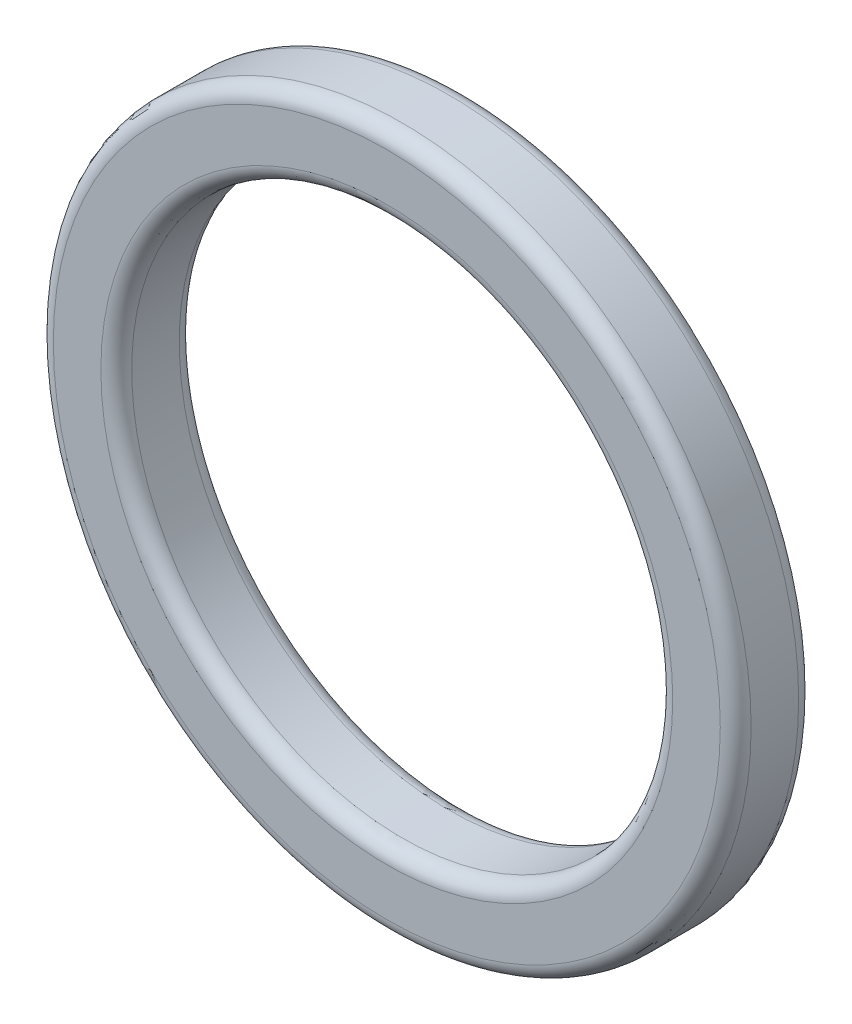
ISO-10303-21;
HEADER;
FILE_DESCRIPTION(('STEP AP214'),'2;1');
FILE_NAME('part.step','',(''),(''),'','','');
FILE_SCHEMA(('AUTOMOTIVE_DESIGN { 1 0 10303 214 1 1 1 1 }'));
ENDSEC;
DATA;
#1=APPLICATION_CONTEXT('core data for automotive mechanical design processes');
#2=APPLICATION_PROTOCOL_DEFINITION('international standard','automotive_design',2000,#1);
#3=PRODUCT_CONTEXT('',#1,'mechanical');
#4=PRODUCT('Part','Part','',(#3));
#5=PRODUCT_RELATED_PRODUCT_CATEGORY('part','',(#4));
#6=PRODUCT_DEFINITION_FORMATION('','',#4);
#7=PRODUCT_DEFINITION_CONTEXT('part definition',#1,'design');
#8=PRODUCT_DEFINITION('design','',#6,#7);
#9=PRODUCT_DEFINITION_SHAPE('','',#8);
#10=(LENGTH_UNIT() NAMED_UNIT(*) SI_UNIT(.MILLI.,.METRE.));
#11=(NAMED_UNIT(*) PLANE_ANGLE_UNIT() SI_UNIT($,.RADIAN.));
#12=(NAMED_UNIT(*) SI_UNIT($,.STERADIAN.) SOLID_ANGLE_UNIT());
#13=UNCERTAINTY_MEASURE_WITH_UNIT(LENGTH_MEASURE(1.E-05),#10,'distance_accuracy_value','');
#14=(GEOMETRIC_REPRESENTATION_CONTEXT(3) GLOBAL_UNCERTAINTY_ASSIGNED_CONTEXT((#13)) GLOBAL_UNIT_ASSIGNED_CONTEXT((#10,
#11,#12)) REPRESENTATION_CONTEXT('',''));
#15=CARTESIAN_POINT('',(0.,0.,0.));
#16=DIRECTION('',(0.,0.,1.));
#17=DIRECTION('',(1.,0.,0.));
#18=AXIS2_PLACEMENT_3D('',#15,#16,#17);
#19=CARTESIAN_POINT('',(39.784875199078,9.63463502334821,5.08));
#20=DIRECTION('',(0.,0.,1.));
#21=DIRECTION('',(1.,0.,0.));
#22=AXIS2_PLACEMENT_3D('',#19,#20,#21);
#23=PLANE('',#22);
#24=CARTESIAN_POINT('',(39.784875199078,9.63463502334821,5.08));
#25=DIRECTION('',(0.,0.,1.));
#26=DIRECTION('',(1.,0.,0.));
#27=AXIS2_PLACEMENT_3D('',#24,#25,#26);
#28=CIRCLE('',#27,18.5328404345795);
#29=CARTESIAN_POINT('',(58.3177156336575,9.63463502334821,5.08));
#30=VERTEX_POINT('',#29);
#31=EDGE_CURVE('E11',#30,#30,#28,.F.);
#32=ORIENTED_EDGE('',*,*,#31,.T.);
#33=EDGE_LOOP('',(#32));
#34=FACE_BOUND('',#33,.T.);
#35=CARTESIAN_POINT('',(39.784875199078,9.63463502334821,5.08));
#36=DIRECTION('',(0.,0.,1.));
#37=DIRECTION('',(1.,0.,0.));
#38=AXIS2_PLACEMENT_3D('',#35,#36,#37);
#39=CIRCLE('',#38,21.6128404345795);
#40=CARTESIAN_POINT('',(61.3977156336575,9.63463502334821,5.08));
#41=VERTEX_POINT('',#40);
#42=EDGE_CURVE('E43',#41,#41,#39,.T.);
#43=ORIENTED_EDGE('',*,*,#42,.T.);
#44=EDGE_LOOP('',(#43));
#45=FACE_BOUND('',#44,.T.);
#46=ADVANCED_FACE('F36',(#34,#45),#23,.T.);
#47=CARTESIAN_POINT('',(39.784875199078,9.63463502334821,0.));
#48=DIRECTION('',(0.,0.,1.));
#49=DIRECTION('',(1.,0.,0.));
#50=AXIS2_PLACEMENT_3D('',#47,#48,#49);
#51=PLANE('',#50);
#52=CARTESIAN_POINT('',(39.784875199078,9.63463502334821,0.));
#53=DIRECTION('',(0.,0.,1.));
#54=DIRECTION('',(1.,0.,0.));
#55=AXIS2_PLACEMENT_3D('',#52,#53,#54);
#56=CIRCLE('',#55,18.5328404345795);
#57=CARTESIAN_POINT('',(58.3177156336575,9.63463502334821,0.));
#58=VERTEX_POINT('',#57);
#59=EDGE_CURVE('E62',#58,#58,#56,.T.);
#60=ORIENTED_EDGE('',*,*,#59,.T.);
#61=EDGE_LOOP('',(#60));
#62=FACE_BOUND('',#61,.T.);
#63=CARTESIAN_POINT('',(39.784875199078,9.63463502334821,0.));
#64=DIRECTION('',(0.,0.,1.));
#65=DIRECTION('',(1.,0.,0.));
#66=AXIS2_PLACEMENT_3D('',#63,#64,#65);
#67=CIRCLE('',#66,21.6128404345795);
#68=CARTESIAN_POINT('',(61.3977156336575,9.63463502334821,0.));
#69=VERTEX_POINT('',#68);
#70=EDGE_CURVE('E65',#69,#69,#67,.F.);
#71=ORIENTED_EDGE('',*,*,#70,.T.);
#72=EDGE_LOOP('',(#71));
#73=FACE_BOUND('',#72,.T.);
#74=ADVANCED_FACE('F69',(#62,#73),#51,.F.);
#75=CARTESIAN_POINT('',(39.784875199078,9.63463502334821,5.08));
#76=DIRECTION('',(0.,0.,-1.));
#77=DIRECTION('',(-1.,0.,0.));
#78=AXIS2_PLACEMENT_3D('',#75,#76,#77);
#79=CYLINDRICAL_SURFACE('',#78,22.6128404345795);
#80=CARTESIAN_POINT('',(39.784875199078,9.63463502334821,1.));
#81=DIRECTION('',(0.,0.,1.));
#82=DIRECTION('',(1.,0.,0.));
#83=AXIS2_PLACEMENT_3D('',#80,#81,#82);
#84=CIRCLE('',#83,22.6128404345795);
#85=CARTESIAN_POINT('',(62.3977156336575,9.63463502334821,1.));
#86=VERTEX_POINT('',#85);
#87=EDGE_CURVE('E47',#86,#86,#84,.T.);
#88=ORIENTED_EDGE('',*,*,#87,.T.);
#89=EDGE_LOOP('',(#88));
#90=FACE_BOUND('',#89,.T.);
#91=CARTESIAN_POINT('',(39.784875199078,9.63463502334821,4.08));
#92=DIRECTION('',(0.,0.,1.));
#93=DIRECTION('',(1.,0.,0.));
#94=AXIS2_PLACEMENT_3D('',#91,#92,#93);
#95=CIRCLE('',#94,22.6128404345795);
#96=CARTESIAN_POINT('',(62.3977156336575,9.63463502334821,4.08));
#97=VERTEX_POINT('',#96);
#98=EDGE_CURVE('E51',#97,#97,#95,.F.);
#99=ORIENTED_EDGE('',*,*,#98,.T.);
#100=EDGE_LOOP('',(#99));
#101=FACE_BOUND('',#100,.T.);
#102=ADVANCED_FACE('F79',(#90,#101),#79,.T.);
#103=CARTESIAN_POINT('',(39.784875199078,9.63463502334821,5.08));
#104=DIRECTION('',(0.,0.,-1.));
#105=DIRECTION('',(-1.,0.,0.));
#106=AXIS2_PLACEMENT_3D('',#103,#104,#105);
#107=CYLINDRICAL_SURFACE('',#106,17.5328404345795);
#108=CARTESIAN_POINT('',(39.784875199078,9.63463502334821,1.));
#109=DIRECTION('',(0.,0.,1.));
#110=DIRECTION('',(1.,0.,0.));
#111=AXIS2_PLACEMENT_3D('',#108,#109,#110);
#112=CIRCLE('',#111,17.5328404345795);
#113=CARTESIAN_POINT('',(57.3177156336575,9.63463502334821,1.));
#114=VERTEX_POINT('',#113);
#115=EDGE_CURVE('E56',#114,#114,#112,.F.);
#116=ORIENTED_EDGE('',*,*,#115,.T.);
#117=EDGE_LOOP('',(#116));
#118=FACE_BOUND('',#117,.T.);
#119=CARTESIAN_POINT('',(39.784875199078,9.63463502334821,4.08));
#120=DIRECTION('',(0.,0.,1.));
#121=DIRECTION('',(1.,0.,0.));
#122=AXIS2_PLACEMENT_3D('',#119,#120,#121);
#123=CIRCLE('',#122,17.5328404345795);
#124=CARTESIAN_POINT('',(57.3177156336575,9.63463502334821,4.08));
#125=VERTEX_POINT('',#124);
#126=EDGE_CURVE('E59',#125,#125,#123,.T.);
#127=ORIENTED_EDGE('',*,*,#126,.T.);
#128=EDGE_LOOP('',(#127));
#129=FACE_BOUND('',#128,.T.);
#130=ADVANCED_FACE('F82',(#118,#129),#107,.F.);
#131=CARTESIAN_POINT('',(39.784875199078,9.63463502334821,1.));
#132=DIRECTION('',(0.,0.,1.));
#133=DIRECTION('',(1.,0.,0.));
#134=AXIS2_PLACEMENT_3D('',#131,#132,#133);
#135=TOROIDAL_SURFACE('',#134,18.5328404345795,1.);
#136=ORIENTED_EDGE('',*,*,#115,.F.);
#137=EDGE_LOOP('',(#136));
#138=FACE_BOUND('',#137,.T.);
#139=ORIENTED_EDGE('',*,*,#59,.F.);
#140=EDGE_LOOP('',(#139));
#141=FACE_BOUND('',#140,.T.);
#142=ADVANCED_FACE('F75',(#138,#141),#135,.T.);
#143=CARTESIAN_POINT('',(39.784875199078,9.63463502334821,1.));
#144=DIRECTION('',(0.,0.,1.));
#145=DIRECTION('',(1.,0.,0.));
#146=AXIS2_PLACEMENT_3D('',#143,#144,#145);
#147=TOROIDAL_SURFACE('',#146,21.6128404345795,1.);
#148=ORIENTED_EDGE('',*,*,#70,.F.);
#149=EDGE_LOOP('',(#148));
#150=FACE_BOUND('',#149,.T.);
#151=ORIENTED_EDGE('',*,*,#87,.F.);
#152=EDGE_LOOP('',(#151));
#153=FACE_BOUND('',#152,.T.);
#154=ADVANCED_FACE('F71',(#150,#153),#147,.T.);
#155=CARTESIAN_POINT('',(39.784875199078,9.63463502334821,4.08));
#156=DIRECTION('',(0.,0.,1.));
#157=DIRECTION('',(1.,0.,0.));
#158=AXIS2_PLACEMENT_3D('',#155,#156,#157);
#159=TOROIDAL_SURFACE('',#158,18.5328404345795,1.);
#160=ORIENTED_EDGE('',*,*,#31,.F.);
#161=EDGE_LOOP('',(#160));
#162=FACE_BOUND('',#161,.T.);
#163=ORIENTED_EDGE('',*,*,#126,.F.);
#164=EDGE_LOOP('',(#163));
#165=FACE_BOUND('',#164,.T.);
#166=ADVANCED_FACE('F74',(#162,#165),#159,.T.);
#167=CARTESIAN_POINT('',(39.784875199078,9.63463502334821,4.08));
#168=DIRECTION('',(0.,0.,1.));
#169=DIRECTION('',(1.,0.,0.));
#170=AXIS2_PLACEMENT_3D('',#167,#168,#169);
#171=TOROIDAL_SURFACE('',#170,21.6128404345795,1.);
#172=ORIENTED_EDGE('',*,*,#98,.F.);
#173=EDGE_LOOP('',(#172));
#174=FACE_BOUND('',#173,.T.);
#175=ORIENTED_EDGE('',*,*,#42,.F.);
#176=EDGE_LOOP('',(#175));
#177=FACE_BOUND('',#176,.T.);
#178=ADVANCED_FACE('F38',(#174,#177),#171,.T.);
#179=CLOSED_SHELL('',(#46,#74,#102,#130,#142,#154,#166,#178));
#180=MANIFOLD_SOLID_BREP('B2',#179);
#181=ADVANCED_BREP_SHAPE_REPRESENTATION('',(#18,#180),#14);
#182=SHAPE_DEFINITION_REPRESENTATION(#9,#181);
ENDSEC;
END-ISO-10303-21;
